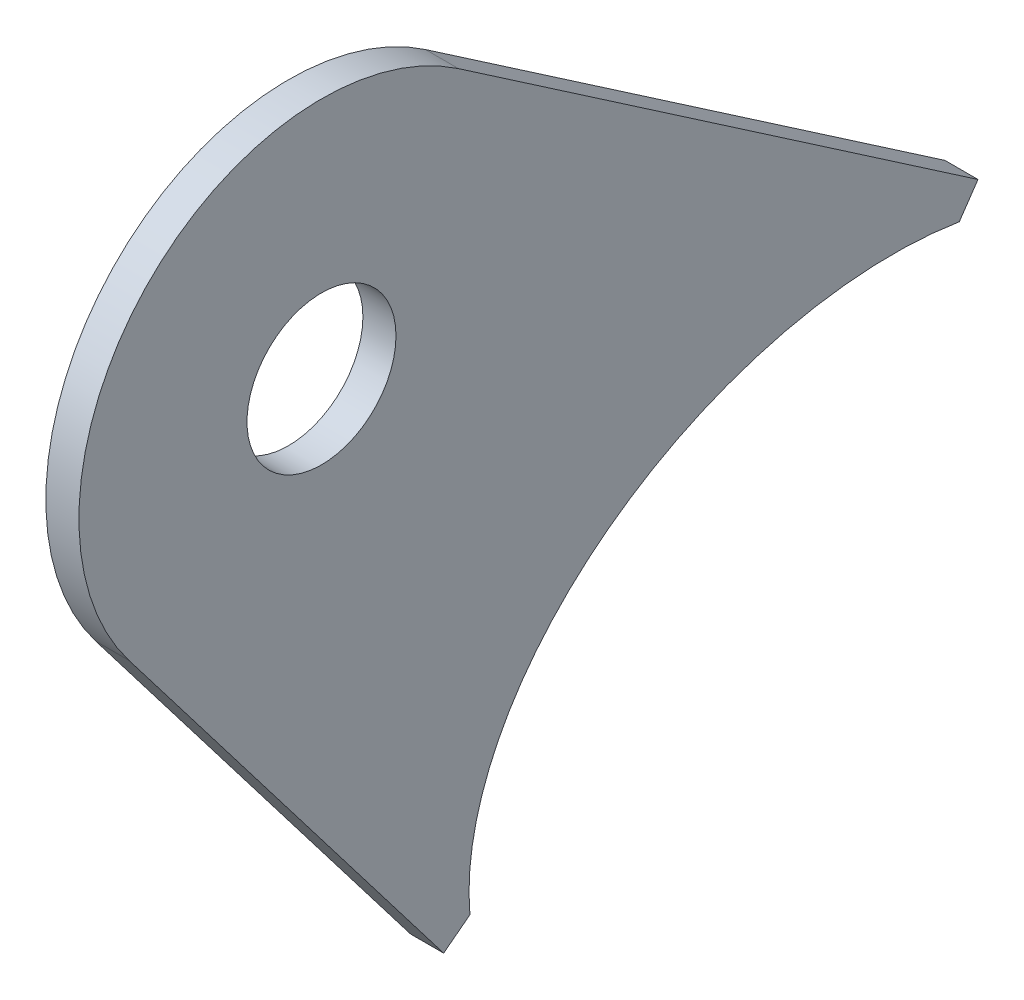
ISO-10303-21;
HEADER;
FILE_DESCRIPTION(('STEP AP214'),'2;1');
FILE_NAME('part.step','',(''),(''),'','','');
FILE_SCHEMA(('AUTOMOTIVE_DESIGN { 1 0 10303 214 1 1 1 1 }'));
ENDSEC;
DATA;
#1=APPLICATION_CONTEXT('core data for automotive mechanical design processes');
#2=APPLICATION_PROTOCOL_DEFINITION('international standard','automotive_design',2000,#1);
#3=PRODUCT_CONTEXT('',#1,'mechanical');
#4=PRODUCT('Part','Part','',(#3));
#5=PRODUCT_RELATED_PRODUCT_CATEGORY('part','',(#4));
#6=PRODUCT_DEFINITION_FORMATION('','',#4);
#7=PRODUCT_DEFINITION_CONTEXT('part definition',#1,'design');
#8=PRODUCT_DEFINITION('design','',#6,#7);
#9=PRODUCT_DEFINITION_SHAPE('','',#8);
#10=(LENGTH_UNIT() NAMED_UNIT(*) SI_UNIT(.MILLI.,.METRE.));
#11=(NAMED_UNIT(*) PLANE_ANGLE_UNIT() SI_UNIT($,.RADIAN.));
#12=(NAMED_UNIT(*) SI_UNIT($,.STERADIAN.) SOLID_ANGLE_UNIT());
#13=UNCERTAINTY_MEASURE_WITH_UNIT(LENGTH_MEASURE(1.E-05),#10,'distance_accuracy_value','');
#14=(GEOMETRIC_REPRESENTATION_CONTEXT(3) GLOBAL_UNCERTAINTY_ASSIGNED_CONTEXT((#13)) GLOBAL_UNIT_ASSIGNED_CONTEXT((#10,
#11,#12)) REPRESENTATION_CONTEXT('',''));
#15=CARTESIAN_POINT('',(0.,0.,0.));
#16=DIRECTION('',(0.,0.,1.));
#17=DIRECTION('',(1.,0.,0.));
#18=AXIS2_PLACEMENT_3D('',#15,#16,#17);
#19=CARTESIAN_POINT('',(-157.5,212.819031379812,-145.733809413006));
#20=DIRECTION('',(0.,0.825088959296692,-0.565002840034191));
#21=DIRECTION('',(0.,0.565002840034192,0.825088959296692));
#22=AXIS2_PLACEMENT_3D('',#19,#20,#21);
#23=PLANE('',#22);
#24=DIRECTION('',(0.,-0.565002840034192,-0.825088959296692));
#25=VECTOR('',#24,1.);
#26=CARTESIAN_POINT('',(-159.,212.819031379812,-145.733809413006));
#27=LINE('',#26,#25);
#28=CARTESIAN_POINT('',(-159.,285.075978552264,-40.2150312403761));
#29=VERTEX_POINT('',#28);
#30=CARTESIAN_POINT('',(-159.,268.94567090721,-63.7705566377127));
#31=VERTEX_POINT('',#30);
#32=EDGE_CURVE('E145',#29,#31,#27,.T.);
#33=ORIENTED_EDGE('',*,*,#32,.F.);
#34=DIRECTION('',(-1.,0.,0.));
#35=VECTOR('',#34,1.);
#36=CARTESIAN_POINT('',(-157.5,285.075978552264,-40.2150312403761));
#37=LINE('',#36,#35);
#38=CARTESIAN_POINT('',(-157.5,285.075978552264,-40.2150312403761));
#39=VERTEX_POINT('',#38);
#40=EDGE_CURVE('E11',#39,#29,#37,.T.);
#41=ORIENTED_EDGE('',*,*,#40,.F.);
#42=DIRECTION('',(0.,-0.565002840034192,-0.825088959296692));
#43=VECTOR('',#42,1.);
#44=CARTESIAN_POINT('',(-157.5,212.819031379812,-145.733809413006));
#45=LINE('',#44,#43);
#46=CARTESIAN_POINT('',(-157.5,268.94567090721,-63.7705566377127));
#47=VERTEX_POINT('',#46);
#48=EDGE_CURVE('E161',#39,#47,#45,.T.);
#49=ORIENTED_EDGE('',*,*,#48,.T.);
#50=DIRECTION('',(-1.,0.,0.));
#51=VECTOR('',#50,1.);
#52=CARTESIAN_POINT('',(-157.5,268.94567090721,-63.7705566377127));
#53=LINE('',#52,#51);
#54=EDGE_CURVE('E52',#47,#31,#53,.T.);
#55=ORIENTED_EDGE('',*,*,#54,.T.);
#56=EDGE_LOOP('',(#33,#41,#49,#55));
#57=FACE_BOUND('',#56,.T.);
#58=ADVANCED_FACE('F36',(#57),#23,.T.);
#59=CARTESIAN_POINT('',(-157.5,276.,-34.));
#60=DIRECTION('',(-1.,0.,0.));
#61=DIRECTION('',(0.,0.,1.));
#62=AXIS2_PLACEMENT_3D('',#59,#60,#61);
#63=CYLINDRICAL_SURFACE('',#62,11.);
#64=CARTESIAN_POINT('',(-159.,276.,-34.));
#65=DIRECTION('',(1.,0.,0.));
#66=DIRECTION('',(0.,0.,-1.));
#67=AXIS2_PLACEMENT_3D('',#64,#65,#66);
#68=CIRCLE('',#67,11.);
#69=CARTESIAN_POINT('',(-159.,269.311400481083,-25.2671518692047));
#70=VERTEX_POINT('',#69);
#71=EDGE_CURVE('E140',#29,#70,#68,.T.);
#72=ORIENTED_EDGE('',*,*,#71,.T.);
#73=DIRECTION('',(-1.,0.,0.));
#74=VECTOR('',#73,1.);
#75=CARTESIAN_POINT('',(-157.5,269.311400481083,-25.2671518692047));
#76=LINE('',#75,#74);
#77=CARTESIAN_POINT('',(-157.5,269.311400481083,-25.2671518692047));
#78=VERTEX_POINT('',#77);
#79=EDGE_CURVE('E44',#78,#70,#76,.T.);
#80=ORIENTED_EDGE('',*,*,#79,.F.);
#81=CARTESIAN_POINT('',(-157.5,276.,-34.));
#82=DIRECTION('',(1.,0.,0.));
#83=DIRECTION('',(0.,0.,-1.));
#84=AXIS2_PLACEMENT_3D('',#81,#82,#83);
#85=CIRCLE('',#84,11.);
#86=EDGE_CURVE('E234',#39,#78,#85,.T.);
#87=ORIENTED_EDGE('',*,*,#86,.F.);
#88=ORIENTED_EDGE('',*,*,#40,.T.);
#89=EDGE_LOOP('',(#72,#80,#87,#88));
#90=FACE_BOUND('',#89,.T.);
#91=ADVANCED_FACE('F131',(#90),#63,.T.);
#92=CARTESIAN_POINT('',(-157.5,111.769831408109,-145.930244519945));
#93=DIRECTION('',(0.,0.608054501719775,-0.793895284617761));
#94=DIRECTION('',(0.,0.793895284617761,0.608054501719775));
#95=AXIS2_PLACEMENT_3D('',#92,#93,#94);
#96=PLANE('',#95);
#97=DIRECTION('',(0.,-0.793895284617761,-0.608054501719775));
#98=VECTOR('',#97,1.);
#99=CARTESIAN_POINT('',(-159.,111.769831408109,-145.930244519945));
#100=LINE('',#99,#98);
#101=CARTESIAN_POINT('',(-159.,250.677253024219,-39.539282547385));
#102=VERTEX_POINT('',#101);
#103=EDGE_CURVE('E144',#70,#102,#100,.T.);
#104=ORIENTED_EDGE('',*,*,#103,.T.);
#105=DIRECTION('',(-1.,0.,0.));
#106=VECTOR('',#105,1.);
#107=CARTESIAN_POINT('',(-157.5,250.677253024219,-39.539282547385));
#108=LINE('',#107,#106);
#109=CARTESIAN_POINT('',(-157.5,250.677253024219,-39.539282547385));
#110=VERTEX_POINT('',#109);
#111=EDGE_CURVE('E111',#110,#102,#108,.T.);
#112=ORIENTED_EDGE('',*,*,#111,.F.);
#113=DIRECTION('',(0.,-0.793895284617761,-0.608054501719775));
#114=VECTOR('',#113,1.);
#115=CARTESIAN_POINT('',(-157.5,111.769831408109,-145.930244519945));
#116=LINE('',#115,#114);
#117=EDGE_CURVE('E99',#78,#110,#116,.T.);
#118=ORIENTED_EDGE('',*,*,#117,.F.);
#119=ORIENTED_EDGE('',*,*,#79,.T.);
#120=EDGE_LOOP('',(#104,#112,#118,#119));
#121=FACE_BOUND('',#120,.T.);
#122=ADVANCED_FACE('F129',(#121),#96,.F.);
#123=CARTESIAN_POINT('',(-157.5,138.907421616126,106.390961972558));
#124=DIRECTION('',(0.,0.793895284617801,0.608054501719724));
#125=DIRECTION('',(0.,-0.608054501719724,0.793895284617801));
#126=AXIS2_PLACEMENT_3D('',#123,#124,#125);
#127=PLANE('',#126);
#128=DIRECTION('',(0.,0.608054501719724,-0.793895284617801));
#129=VECTOR('',#128,1.);
#130=CARTESIAN_POINT('',(-159.,138.907421616126,106.390961972558));
#131=LINE('',#130,#129);
#132=CARTESIAN_POINT('',(-159.,251.589334776799,-40.7301254743117));
#133=VERTEX_POINT('',#132);
#134=EDGE_CURVE('E108',#102,#133,#131,.T.);
#135=ORIENTED_EDGE('',*,*,#134,.T.);
#136=DIRECTION('',(-1.,0.,0.));
#137=VECTOR('',#136,1.);
#138=CARTESIAN_POINT('',(-157.5,251.589334776799,-40.7301254743117));
#139=LINE('',#138,#137);
#140=CARTESIAN_POINT('',(-157.5,251.589334776799,-40.7301254743117));
#141=VERTEX_POINT('',#140);
#142=EDGE_CURVE('E105',#141,#133,#139,.T.);
#143=ORIENTED_EDGE('',*,*,#142,.F.);
#144=DIRECTION('',(0.,0.608054501719724,-0.793895284617801));
#145=VECTOR('',#144,1.);
#146=CARTESIAN_POINT('',(-157.5,138.907421616126,106.390961972558));
#147=LINE('',#146,#145);
#148=EDGE_CURVE('E90',#110,#141,#147,.T.);
#149=ORIENTED_EDGE('',*,*,#148,.F.);
#150=ORIENTED_EDGE('',*,*,#111,.T.);
#151=EDGE_LOOP('',(#135,#143,#149,#150));
#152=FACE_BOUND('',#151,.T.);
#153=ADVANCED_FACE('F106',(#152),#127,.F.);
#154=CARTESIAN_POINT('',(-157.5,254.755978841872,-57.1231051206219));
#155=DIRECTION('',(1.,0.,0.));
#156=DIRECTION('',(0.,-0.322208395616547,0.946668764560345));
#157=AXIS2_PLACEMENT_3D('',#154,#155,#156);
#158=ELLIPSE('',#157,16.8132203137076,12.7);
#159=DIRECTION('',(-1.,0.,0.));
#160=VECTOR('',#159,1.);
#161=SURFACE_OF_LINEAR_EXTRUSION('',#158,#160);
#162=CARTESIAN_POINT('',(-159.,254.755978841872,-57.1231051206219));
#163=DIRECTION('',(1.,0.,0.));
#164=DIRECTION('',(0.,-0.322208395616547,0.946668764560345));
#165=AXIS2_PLACEMENT_3D('',#162,#163,#164);
#166=ELLIPSE('',#165,16.8132203137076,12.7);
#167=CARTESIAN_POINT('',(-159.,267.708037468265,-62.9230523776614));
#168=VERTEX_POINT('',#167);
#169=EDGE_CURVE('E150',#168,#133,#166,.T.);
#170=ORIENTED_EDGE('',*,*,#169,.F.);
#171=DIRECTION('',(-1.,0.,0.));
#172=VECTOR('',#171,1.);
#173=CARTESIAN_POINT('',(-157.5,267.708037468265,-62.9230523776614));
#174=LINE('',#173,#172);
#175=CARTESIAN_POINT('',(-157.5,267.708037468265,-62.9230523776614));
#176=VERTEX_POINT('',#175);
#177=EDGE_CURVE('E71',#176,#168,#174,.T.);
#178=ORIENTED_EDGE('',*,*,#177,.F.);
#179=EDGE_CURVE('E97',#176,#141,#158,.T.);
#180=ORIENTED_EDGE('',*,*,#179,.T.);
#181=ORIENTED_EDGE('',*,*,#142,.T.);
#182=EDGE_LOOP('',(#170,#178,#180,#181));
#183=FACE_BOUND('',#182,.T.);
#184=ADVANCED_FACE('F113',(#183),#161,.T.);
#185=CARTESIAN_POINT('',(-157.5,56.1266395274018,81.9632527752963));
#186=DIRECTION('',(0.,-0.565002840034206,-0.825088959296682));
#187=DIRECTION('',(0.,0.825088959296682,-0.565002840034206));
#188=AXIS2_PLACEMENT_3D('',#185,#186,#187);
#189=PLANE('',#188);
#190=DIRECTION('',(0.,-0.825088959296682,0.565002840034206));
#191=VECTOR('',#190,1.);
#192=CARTESIAN_POINT('',(-159.,56.1266395274018,81.9632527752963));
#193=LINE('',#192,#191);
#194=EDGE_CURVE('E155',#31,#168,#193,.T.);
#195=ORIENTED_EDGE('',*,*,#194,.F.);
#196=ORIENTED_EDGE('',*,*,#54,.F.);
#197=DIRECTION('',(0.,-0.825088959296682,0.565002840034206));
#198=VECTOR('',#197,1.);
#199=CARTESIAN_POINT('',(-157.5,56.1266395274018,81.9632527752963));
#200=LINE('',#199,#198);
#201=EDGE_CURVE('E114',#47,#176,#200,.T.);
#202=ORIENTED_EDGE('',*,*,#201,.T.);
#203=ORIENTED_EDGE('',*,*,#177,.T.);
#204=EDGE_LOOP('',(#195,#196,#202,#203));
#205=FACE_BOUND('',#204,.T.);
#206=ADVANCED_FACE('F125',(#205),#189,.T.);
#207=CARTESIAN_POINT('',(-157.5,276.,-34.));
#208=DIRECTION('',(-1.,0.,0.));
#209=DIRECTION('',(0.,0.,1.));
#210=AXIS2_PLACEMENT_3D('',#207,#208,#209);
#211=CYLINDRICAL_SURFACE('',#210,3.3782);
#212=CARTESIAN_POINT('',(-157.5,276.,-34.));
#213=DIRECTION('',(1.,0.,0.));
#214=DIRECTION('',(0.,0.,-1.));
#215=AXIS2_PLACEMENT_3D('',#212,#213,#214);
#216=CIRCLE('',#215,3.3782);
#217=CARTESIAN_POINT('',(-157.5,276.,-37.3782));
#218=VERTEX_POINT('',#217);
#219=EDGE_CURVE('E116',#218,#218,#216,.F.);
#220=ORIENTED_EDGE('',*,*,#219,.F.);
#221=EDGE_LOOP('',(#220));
#222=FACE_BOUND('',#221,.T.);
#223=CARTESIAN_POINT('',(-159.,276.,-34.));
#224=DIRECTION('',(1.,0.,0.));
#225=DIRECTION('',(0.,0.,-1.));
#226=AXIS2_PLACEMENT_3D('',#223,#224,#225);
#227=CIRCLE('',#226,3.3782);
#228=CARTESIAN_POINT('',(-159.,276.,-37.3782));
#229=VERTEX_POINT('',#228);
#230=EDGE_CURVE('E158',#229,#229,#227,.F.);
#231=ORIENTED_EDGE('',*,*,#230,.T.);
#232=EDGE_LOOP('',(#231));
#233=FACE_BOUND('',#232,.T.);
#234=ADVANCED_FACE('F167',(#222,#233),#211,.F.);
#235=CARTESIAN_POINT('',(-157.5,0.,0.));
#236=DIRECTION('',(1.,0.,0.));
#237=DIRECTION('',(0.,0.,-1.));
#238=AXIS2_PLACEMENT_3D('',#235,#236,#237);
#239=PLANE('',#238);
#240=ORIENTED_EDGE('',*,*,#48,.F.);
#241=ORIENTED_EDGE('',*,*,#86,.T.);
#242=ORIENTED_EDGE('',*,*,#117,.T.);
#243=ORIENTED_EDGE('',*,*,#148,.T.);
#244=ORIENTED_EDGE('',*,*,#179,.F.);
#245=ORIENTED_EDGE('',*,*,#201,.F.);
#246=EDGE_LOOP('',(#240,#241,#242,#243,#244,#245));
#247=FACE_BOUND('',#246,.T.);
#248=ORIENTED_EDGE('',*,*,#219,.T.);
#249=EDGE_LOOP('',(#248));
#250=FACE_BOUND('',#249,.T.);
#251=ADVANCED_FACE('F93',(#247,#250),#239,.T.);
#252=CARTESIAN_POINT('',(-159.,0.,0.));
#253=DIRECTION('',(1.,0.,0.));
#254=DIRECTION('',(0.,0.,-1.));
#255=AXIS2_PLACEMENT_3D('',#252,#253,#254);
#256=PLANE('',#255);
#257=ORIENTED_EDGE('',*,*,#32,.T.);
#258=ORIENTED_EDGE('',*,*,#194,.T.);
#259=ORIENTED_EDGE('',*,*,#169,.T.);
#260=ORIENTED_EDGE('',*,*,#134,.F.);
#261=ORIENTED_EDGE('',*,*,#103,.F.);
#262=ORIENTED_EDGE('',*,*,#71,.F.);
#263=EDGE_LOOP('',(#257,#258,#259,#260,#261,#262));
#264=FACE_BOUND('',#263,.T.);
#265=ORIENTED_EDGE('',*,*,#230,.F.);
#266=EDGE_LOOP('',(#265));
#267=FACE_BOUND('',#266,.T.);
#268=ADVANCED_FACE('F147',(#264,#267),#256,.F.);
#269=CLOSED_SHELL('',(#58,#91,#122,#153,#184,#206,#234,#251,#268));
#270=MANIFOLD_SOLID_BREP('B2',#269);
#271=ADVANCED_BREP_SHAPE_REPRESENTATION('',(#18,#270),#14);
#272=SHAPE_DEFINITION_REPRESENTATION(#9,#271);
ENDSEC;
END-ISO-10303-21;
